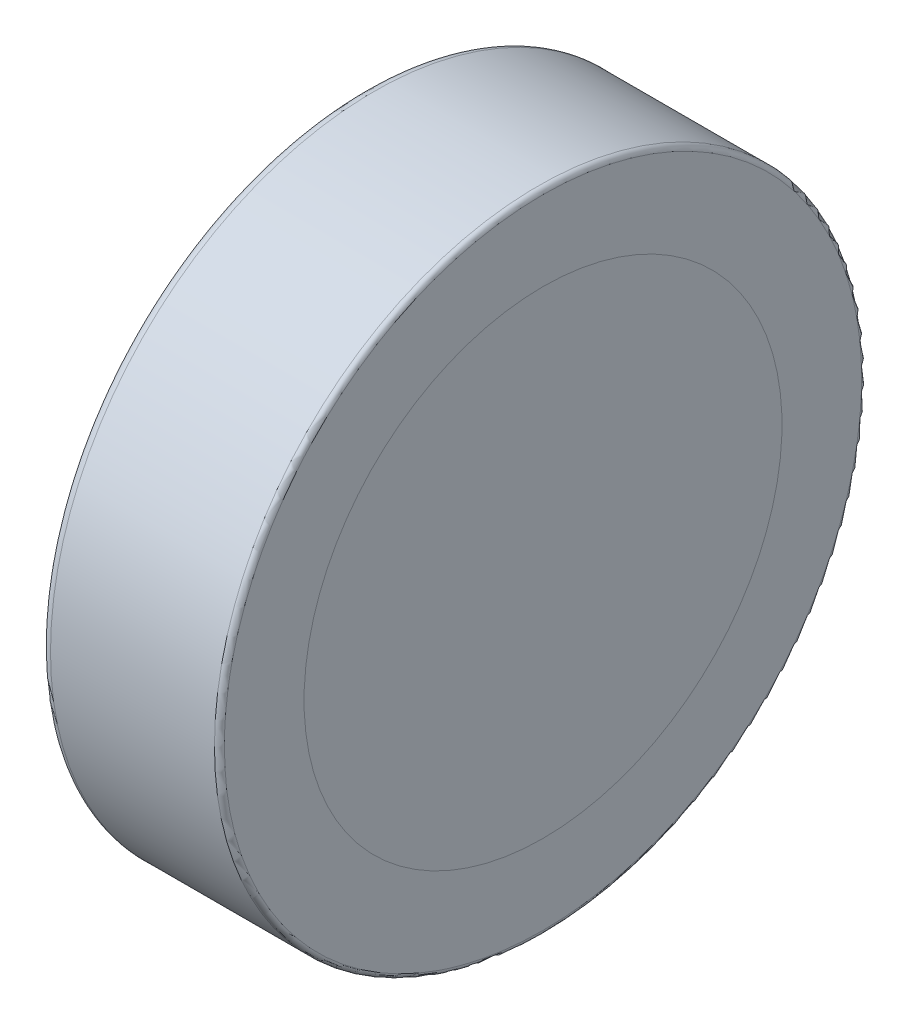
ISO-10303-21;
HEADER;
FILE_DESCRIPTION(('STEP AP214'),'2;1');
FILE_NAME('part.step','',(''),(''),'','','');
FILE_SCHEMA(('AUTOMOTIVE_DESIGN { 1 0 10303 214 1 1 1 1 }'));
ENDSEC;
DATA;
#1=APPLICATION_CONTEXT('core data for automotive mechanical design processes');
#2=APPLICATION_PROTOCOL_DEFINITION('international standard','automotive_design',2000,#1);
#3=PRODUCT_CONTEXT('',#1,'mechanical');
#4=PRODUCT('Part','Part','',(#3));
#5=PRODUCT_RELATED_PRODUCT_CATEGORY('part','',(#4));
#6=PRODUCT_DEFINITION_FORMATION('','',#4);
#7=PRODUCT_DEFINITION_CONTEXT('part definition',#1,'design');
#8=PRODUCT_DEFINITION('design','',#6,#7);
#9=PRODUCT_DEFINITION_SHAPE('','',#8);
#10=(LENGTH_UNIT() NAMED_UNIT(*) SI_UNIT(.MILLI.,.METRE.));
#11=(NAMED_UNIT(*) PLANE_ANGLE_UNIT() SI_UNIT($,.RADIAN.));
#12=(NAMED_UNIT(*) SI_UNIT($,.STERADIAN.) SOLID_ANGLE_UNIT());
#13=UNCERTAINTY_MEASURE_WITH_UNIT(LENGTH_MEASURE(1.E-05),#10,'distance_accuracy_value','');
#14=(GEOMETRIC_REPRESENTATION_CONTEXT(3) GLOBAL_UNCERTAINTY_ASSIGNED_CONTEXT((#13)) GLOBAL_UNIT_ASSIGNED_CONTEXT((#10,
#11,#12)) REPRESENTATION_CONTEXT('',''));
#15=CARTESIAN_POINT('',(0.,0.,0.));
#16=DIRECTION('',(0.,0.,1.));
#17=DIRECTION('',(1.,0.,0.));
#18=AXIS2_PLACEMENT_3D('',#15,#16,#17);
#19=CARTESIAN_POINT('',(0.,0.,0.));
#20=CARTESIAN_POINT('',(0.,0.05210462956972,0.));
#21=CARTESIAN_POINT('',(0.000691743719357,0.1284688546661,0.));
#22=CARTESIAN_POINT('',(0.002807581872069,0.2275721547956,0.));
#23=CARTESIAN_POINT('',(0.004859000108526,0.2964452651658,0.));
#24=CARTESIAN_POINT('',(0.007338098680728,0.3623728956788,0.));
#25=CARTESIAN_POINT('',(0.01108175794887,0.446332212166,0.));
#26=CARTESIAN_POINT('',(0.01659405408443,0.5467939628838,0.));
#27=CARTESIAN_POINT('',(0.02452405060196,0.6623831661137,0.));
#28=CARTESIAN_POINT('',(0.03342034570394,0.7718529726198,0.));
#29=CARTESIAN_POINT('',(0.04312301043329,0.8759479775652,0.));
#30=CARTESIAN_POINT('',(0.0567565751218,1.005972165797,0.));
#31=CARTESIAN_POINT('',(0.07535064032635,1.159556440921,0.));
#32=CARTESIAN_POINT('',(0.1001603521466,1.334563784432,0.));
#33=CARTESIAN_POINT('',(0.126567923967,1.498735088347,0.));
#34=CARTESIAN_POINT('',(0.1628739328407,1.701036667309,0.));
#35=CARTESIAN_POINT('',(0.2113052265627,1.93751980655,0.));
#36=CARTESIAN_POINT('',(0.264899151646,2.163486720934,0.));
#37=CARTESIAN_POINT('',(0.3091323544031,2.333670503212,0.));
#38=CARTESIAN_POINT('',(0.3423389397371,2.454767455131,0.));
#39=CARTESIAN_POINT('',(0.3764926118203,2.573083380578,0.));
#40=CARTESIAN_POINT('',(0.401257654654,2.654976060904,0.));
#41=CARTESIAN_POINT('',(0.4145214949657,2.697749178215,0.));
#42=CARTESIAN_POINT('',(0.4157253445419,2.701622611334,0.));
#43=(BOUNDED_CURVE() B_SPLINE_CURVE(3,(#19,#20,#21,#22,#23,#24,#25,#26,#27,#28,#29,#30,#31,#32,
#33,#34,#35,#36,#37,#38,#39,#40,#41,#42),.UNSPECIFIED.,.F.,.F.) B_SPLINE_CURVE_WITH_KNOTS((4,1,
1,1,1,1,1,1,1,1,1,1,1,1,1,1,1,1,1,1,1,4),(0.,0.05696984657492,0.08349251728804,0.1083809270558,
0.1323063759205,0.155626371483,0.2002704933321,0.2423100109975,0.2823020909419,0.3203536018846,
0.3566154027821,0.425244082915,0.4894911137433,0.5498654616583,0.6070413953905,0.714206745952,
0.8137482966662,0.8609231050626,0.9064589435848,0.9510359757461,0.9955650489481,1.),
.UNSPECIFIED.) CURVE() GEOMETRIC_REPRESENTATION_ITEM() RATIONAL_B_SPLINE_CURVE((1.,1.,1.,1.,1.,
1.,1.,1.,1.,1.,1.,1.,1.,1.,1.,1.,1.,1.,1.,1.,1.,1.,1.,1.)) REPRESENTATION_ITEM(''));
#44=CARTESIAN_POINT('',(-0.110426619,0.,0.));
#45=DIRECTION('',(-1.,0.,0.));
#46=AXIS1_PLACEMENT('',#44,#45);
#47=SURFACE_OF_REVOLUTION('',#43,#46);
#48=CARTESIAN_POINT('',(0.,0.,0.));
#49=VERTEX_POINT('',#48);
#50=VERTEX_LOOP('',#49);
#51=FACE_BOUND('',#50,.T.);
#52=CARTESIAN_POINT('',(0.407699374531264,0.,0.));
#53=DIRECTION('',(1.,0.,0.));
#54=DIRECTION('',(0.,-0.999999564133861,0.000933665939788664));
#55=AXIS2_PLACEMENT_3D('',#52,#53,#54);
#56=CIRCLE('',#55,2.67566858006498);
#57=CARTESIAN_POINT('',(0.407699374531264,-2.67566741383165,0.00249818061936937));
#58=VERTEX_POINT('',#57);
#59=EDGE_CURVE('E64',#58,#58,#56,.F.);
#60=ORIENTED_EDGE('',*,*,#59,.T.);
#61=EDGE_LOOP('',(#60));
#62=FACE_BOUND('',#61,.T.);
#63=ADVANCED_FACE('F15',(#51,#62),#47,.F.);
#64=CARTESIAN_POINT('',(0.3121211975973,0.,0.));
#65=DIRECTION('',(1.,0.,0.));
#66=DIRECTION('',(0.,-0.999999564133861,0.000933665939788664));
#67=AXIS2_PLACEMENT_3D('',#64,#65,#66);
#68=TOROIDAL_SURFACE('',#67,2.705076267733,0.1);
#69=CARTESIAN_POINT('',(0.4121211975973,0.,0.));
#70=DIRECTION('',(-1.,0.,0.));
#71=DIRECTION('',(0.,1.,0.));
#72=AXIS2_PLACEMENT_3D('',#69,#70,#71);
#73=CIRCLE('',#72,2.7050762677225);
#74=CARTESIAN_POINT('',(0.4121211975973,-2.7050762677183,0.));
#75=VERTEX_POINT('',#74);
#76=CARTESIAN_POINT('',(0.4121211975973,2.7050762677183,0.));
#77=VERTEX_POINT('',#76);
#78=EDGE_CURVE('E197',#75,#77,#73,.F.);
#79=ORIENTED_EDGE('',*,*,#78,.F.);
#80=CARTESIAN_POINT('',(0.4121211975973,-2.705076267712,0.));
#81=CARTESIAN_POINT('',(0.412121197595779,-2.70507594866538,0.000841876478011887));
#82=CARTESIAN_POINT('',(0.412121197594299,-2.70507524148156,0.00168375551697466));
#83=CARTESIAN_POINT('',(0.412121197516631,-2.7050162000783,0.0470641840690194));
#84=CARTESIAN_POINT('',(0.412121197548796,-2.70387195698707,0.0916087202426596));
#85=CARTESIAN_POINT('',(0.41212119698625,-2.69937197879863,0.181399161037708));
#86=CARTESIAN_POINT('',(0.412121196380058,-2.69597615775904,0.226642983681117));
#87=CARTESIAN_POINT('',(0.41212115323586,-2.68693932793262,0.31689388639987));
#88=CARTESIAN_POINT('',(0.412121110711048,-2.68129902585015,0.361901036479485));
#89=CARTESIAN_POINT('',(0.41212080987294,-2.66937697683153,0.441129098101552));
#90=CARTESIAN_POINT('',(0.412120604145867,-2.66355087729823,0.475419858677809));
#91=CARTESIAN_POINT('',(0.412120006021443,-2.64661619862147,0.564524892862536));
#92=CARTESIAN_POINT('',(0.412119576171417,-2.63444937133538,0.619143750704688));
#93=CARTESIAN_POINT('',(0.412119450723772,-2.60927039123773,0.717206774535503));
#94=CARTESIAN_POINT('',(0.41211963137773,-2.59685575805295,0.760806440257988));
#95=CARTESIAN_POINT('',(0.412120249233156,-2.56983133195316,0.847281762607399));
#96=CARTESIAN_POINT('',(0.412120686198422,-2.55522356930244,0.890158048480771));
#97=CARTESIAN_POINT('',(0.41212108824896,-2.53134083452116,0.95449082572087));
#98=CARTESIAN_POINT('',(0.41212117937801,-2.5229095666168,0.976264041529427));
#99=CARTESIAN_POINT('',(0.412121205038305,-2.51073398388129,1.00680989090429));
#100=CARTESIAN_POINT('',(0.412121200314658,-2.50716731485812,1.01565425491872));
#101=CARTESIAN_POINT('',(0.412121175827272,-2.48409958806341,1.07204504135777));
#102=CARTESIAN_POINT('',(0.412121181034625,-2.4633619504549,1.11909927895228));
#103=CARTESIAN_POINT('',(0.412120976175299,-2.4277015965774,1.19411238412908));
#104=CARTESIAN_POINT('',(0.412120847981517,-2.41360266848985,1.22246741779828));
#105=CARTESIAN_POINT('',(0.412120515708989,-2.38352353437018,1.28038780384479));
#106=CARTESIAN_POINT('',(0.412120307460483,-2.36748098610239,1.30992080973027));
#107=CARTESIAN_POINT('',(0.412119825165105,-2.32759951450314,1.38014455592881));
#108=CARTESIAN_POINT('',(0.412119558435392,-2.30322473364989,1.42053389198287));
#109=CARTESIAN_POINT('',(0.412119433880697,-2.27195180989262,1.46935472857995));
#110=CARTESIAN_POINT('',(0.412119419343729,-2.2660547674011,1.47843742122417));
#111=CARTESIAN_POINT('',(0.412119382770715,-2.24025117040221,1.5176552207492));
#112=CARTESIAN_POINT('',(0.412119422486852,-2.21978523973986,1.54742551737038));
#113=CARTESIAN_POINT('',(0.412119615082913,-2.17008788221289,1.61666526646487));
#114=CARTESIAN_POINT('',(0.412119803523228,-2.14035105060356,1.65577253176815));
#115=CARTESIAN_POINT('',(0.41212027796573,-2.07880070136791,1.73228283360008));
#116=CARTESIAN_POINT('',(0.412120563914527,-2.04698832786471,1.76968679007217));
#117=CARTESIAN_POINT('',(0.412121002437545,-1.98086943613019,1.84311540439738));
#118=CARTESIAN_POINT('',(0.412121153210296,-1.9465356427806,1.87911548756725));
#119=CARTESIAN_POINT('',(0.412121225748504,-1.88899267168601,1.93649958133768));
#120=CARTESIAN_POINT('',(0.412121211104329,-1.86630763588436,1.95841355111555));
#121=CARTESIAN_POINT('',(0.412121165183082,-1.8237595688927,1.9981187663924));
#122=CARTESIAN_POINT('',(0.412121136828344,-1.80400262794068,2.01602350596534));
#123=CARTESIAN_POINT('',(0.412120998394618,-1.75816210091293,2.056357476475));
#124=CARTESIAN_POINT('',(0.412120866985381,-1.73190651525706,2.07859168702256));
#125=CARTESIAN_POINT('',(0.412120539287769,-1.6813408554444,2.11977844873468));
#126=CARTESIAN_POINT('',(0.412120351175665,-1.65711271526354,2.13883169762503));
#127=CARTESIAN_POINT('',(0.412120002529433,-1.6104669334803,2.17422543195386));
#128=CARTESIAN_POINT('',(0.412119841118574,-1.58811050721243,2.19064666711174));
#129=CARTESIAN_POINT('',(0.412119561604022,-1.53857707107697,2.22584999589178));
#130=CARTESIAN_POINT('',(0.412119457654225,-1.51129469483883,2.24448418148387));
#131=CARTESIAN_POINT('',(0.412119395044954,-1.45826243708839,2.27927194677585));
#132=CARTESIAN_POINT('',(0.4121194254337,-1.43256442749078,2.29550474012419));
#133=CARTESIAN_POINT('',(0.412119539540447,-1.38063920732634,2.32708236825473));
#134=CARTESIAN_POINT('',(0.412119623241735,-1.35441216510547,2.34242747968102));
#135=CARTESIAN_POINT('',(0.412119824494285,-1.30653738680668,2.36935371241533));
#136=CARTESIAN_POINT('',(0.412119932455138,-1.28497772791749,2.38109165532872));
#137=CARTESIAN_POINT('',(0.412120166524876,-1.24155012765164,2.4039661571606));
#138=CARTESIAN_POINT('',(0.412120292628816,-1.21968227174503,2.41510287882829));
#139=CARTESIAN_POINT('',(0.412120672151375,-1.15364977377421,2.44759614766522));
#140=CARTESIAN_POINT('',(0.412120926910353,-1.10903395176535,2.46804830937459));
#141=CARTESIAN_POINT('',(0.412121150396383,-1.04081559355675,2.49706788622033));
#142=CARTESIAN_POINT('',(0.412121198065071,-1.0176001714429,2.50655854276324));
#143=CARTESIAN_POINT('',(0.412121197182678,-0.97360675433624,2.52384028679304));
#144=CARTESIAN_POINT('',(0.412121159086963,-0.952856178845155,2.53170119394997));
#145=CARTESIAN_POINT('',(0.412121046010549,-0.889392224438764,2.55488590439233));
#146=CARTESIAN_POINT('',(0.412120974088265,-0.846388740156109,2.56942375963757));
#147=CARTESIAN_POINT('',(0.412120993531711,-0.759772382406192,2.59637938990315));
#148=CARTESIAN_POINT('',(0.412121084731759,-0.716160171855171,2.60879930207658));
#149=CARTESIAN_POINT('',(0.41212126730586,-0.628416940855727,2.63147185769049));
#150=CARTESIAN_POINT('',(0.412121358679672,-0.584286440841775,2.64172650673898));
#151=CARTESIAN_POINT('',(0.412120586935178,-0.528410292130013,2.65334617391147));
#152=CARTESIAN_POINT('',(0.412120379956183,-0.516859745935704,2.65567521281033));
#153=CARTESIAN_POINT('',(0.412120085081168,-0.487989708847852,2.66123985772122));
#154=CARTESIAN_POINT('',(0.412120106943632,-0.470646466724459,2.66435312100657));
#155=CARTESIAN_POINT('',(0.412120206535916,-0.426230649904482,2.67187414417753));
#156=CARTESIAN_POINT('',(0.412120308592492,-0.399116958255985,2.67603764166973));
#157=CARTESIAN_POINT('',(0.412120568740461,-0.332808050669356,2.68517663792776));
#158=CARTESIAN_POINT('',(0.412120731718784,-0.293549744869248,2.68970249994354));
#159=CARTESIAN_POINT('',(0.412120948919075,-0.226097167074397,2.69598517139672));
#160=CARTESIAN_POINT('',(0.41212102090252,-0.197941142517661,2.69816359324299));
#161=CARTESIAN_POINT('',(0.412121116519947,-0.146698824659073,2.70132482054776));
#162=CARTESIAN_POINT('',(0.412121146564754,-0.123621453857955,2.7024529901562));
#163=CARTESIAN_POINT('',(0.41212119299744,-0.0666176064524484,2.70451414519423));
#164=CARTESIAN_POINT('',(0.412121196373415,-0.0326785352027483,2.70510749229993));
#165=CARTESIAN_POINT('',(0.412121199214687,0.0461305131416268,2.70503375675536));
#166=CARTESIAN_POINT('',(0.412121197070421,0.0910007835974372,2.70389921700952));
#167=CARTESIAN_POINT('',(0.412121194224446,0.181042098578864,2.6993698416311));
#168=CARTESIAN_POINT('',(0.412121193536232,0.226212096940261,2.69595424147889));
#169=CARTESIAN_POINT('',(0.412121192657476,0.31632411820363,2.68686617773267));
#170=CARTESIAN_POINT('',(0.41212119246693,0.361266142251395,2.68119372549296));
#171=CARTESIAN_POINT('',(0.412121193195854,0.450809226818168,2.66760202041036));
#172=CARTESIAN_POINT('',(0.412121194115321,0.495410287864116,2.6596827710405));
#173=CARTESIAN_POINT('',(0.412121196092519,0.584159186847491,2.64161866828816));
#174=CARTESIAN_POINT('',(0.412121197150249,0.628307023905747,2.63147381058926));
#175=CARTESIAN_POINT('',(0.412121197853056,0.716039758378451,2.60898299543482));
#176=CARTESIAN_POINT('',(0.412121197498124,0.759624652737868,2.59663702603945));
#177=CARTESIAN_POINT('',(0.412121192752846,0.840245993657995,2.57160095201263));
#178=CARTESIAN_POINT('',(0.412121188916908,0.877368130082561,2.55918512972018));
#179=CARTESIAN_POINT('',(0.412121174326753,0.966531119661922,2.52719672817725));
#180=CARTESIAN_POINT('',(0.412121161341991,1.01828276754597,2.50680981535198));
#181=CARTESIAN_POINT('',(0.412121131491673,1.11432148638696,2.46551187469932));
#182=CARTESIAN_POINT('',(0.412121115275374,1.15876149331517,2.44495466879755));
#183=CARTESIAN_POINT('',(0.412121078929547,1.24646241689806,2.401458075243));
#184=CARTESIAN_POINT('',(0.412121058799954,1.28972331383293,2.37851864778001));
#185=CARTESIAN_POINT('',(0.412121015590482,1.37493674485167,2.33032552107743));
#186=CARTESIAN_POINT('',(0.412120992510557,1.41688925818084,2.3050717851513));
#187=CARTESIAN_POINT('',(0.412120944190378,1.49936263111944,2.2523243292997));
#188=CARTESIAN_POINT('',(0.412120918950092,1.539883469251,2.22483057579013));
#189=CARTESIAN_POINT('',(0.412120867070133,1.61937387521139,2.16768407372463));
#190=CARTESIAN_POINT('',(0.412120840430442,1.65834342110285,2.13803129465392));
#191=CARTESIAN_POINT('',(0.41212078647743,1.73461624873378,2.07665419523025));
#192=CARTESIAN_POINT('',(0.412120759164101,1.77191950834315,2.04492984737835));
#193=CARTESIAN_POINT('',(0.412120704435095,1.84475002284486,1.97950271902275));
#194=CARTESIAN_POINT('',(0.412120677019417,1.88027725567703,1.94579991395578));
#195=CARTESIAN_POINT('',(0.41212062298586,1.94944979460938,1.87651656590772));
#196=CARTESIAN_POINT('',(0.41212059636799,1.98309507895187,1.8409360012266));
#197=CARTESIAN_POINT('',(0.412120539454704,2.05320067058093,1.76264537083127));
#198=CARTESIAN_POINT('',(0.412120509192837,2.08934951548962,1.71965529684648));
#199=CARTESIAN_POINT('',(0.412120462762046,2.14889135925283,1.64419511932205));
#200=CARTESIAN_POINT('',(0.412120445043324,2.17296230248963,1.61225645665041));
#201=CARTESIAN_POINT('',(0.412120414692026,2.22368135479544,1.54175727251509));
#202=CARTESIAN_POINT('',(0.412120403458366,2.25006066844562,1.50300262888491));
#203=CARTESIAN_POINT('',(0.412120390695596,2.30076771470105,1.42417539198112));
#204=CARTESIAN_POINT('',(0.412120389166423,2.3250954603915,1.38410280711581));
#205=CARTESIAN_POINT('',(0.41212039622326,2.37163443989757,1.3027470312233));
#206=CARTESIAN_POINT('',(0.412120404809178,2.39384569306812,1.26146385127129));
#207=CARTESIAN_POINT('',(0.412120431528546,2.43609135195957,1.17779903511758));
#208=CARTESIAN_POINT('',(0.412120449661883,2.45612578360957,1.13541741200738));
#209=CARTESIAN_POINT('',(0.412120494458531,2.49396368132689,1.04967042655508));
#210=CARTESIAN_POINT('',(0.412120521121717,2.51176718014013,1.00630507866324));
#211=CARTESIAN_POINT('',(0.412120581368945,2.54509506825052,0.918708133988963));
#212=CARTESIAN_POINT('',(0.412120614952865,2.56061949730584,0.874476552333159));
#213=CARTESIAN_POINT('',(0.412120686879076,2.58934730829846,0.785266945148846));
#214=CARTESIAN_POINT('',(0.412120725221269,2.60255073714754,0.740288934727178));
#215=CARTESIAN_POINT('',(0.412120803937014,2.62660091348624,0.649708301628215));
#216=CARTESIAN_POINT('',(0.412120844310518,2.63744771512901,0.604105693329212));
#217=CARTESIAN_POINT('',(0.412120923803744,2.65675536710629,0.512399379056237));
#218=CARTESIAN_POINT('',(0.412120962923497,2.66521627886936,0.466295686015239));
#219=CARTESIAN_POINT('',(0.412121036051487,2.67972948285284,0.373712075035544));
#220=CARTESIAN_POINT('',(0.412121070059869,2.68578184375185,0.327232167862967));
#221=CARTESIAN_POINT('',(0.412121128586215,2.69546134251778,0.234021987541543));
#222=CARTESIAN_POINT('',(0.412121153104477,2.69908855625014,0.187291722270705));
#223=CARTESIAN_POINT('',(0.412121187559247,2.70390950008654,0.093707447165551));
#224=CARTESIAN_POINT('',(0.412121197496251,2.70510331305185,0.0468534415991964));
#225=CARTESIAN_POINT('',(0.4121211975973,2.705076267712,0.));
#226=B_SPLINE_CURVE_WITH_KNOTS('',3,(#80,#81,#82,#83,#84,#85,#86,#87,#88,#89,#90,#91,#92,#93,
#94,#95,#96,#97,#98,#99,#100,#101,#102,#103,#104,#105,#106,#107,#108,#109,#110,#111,#112,#113,
#114,#115,#116,#117,#118,#119,#120,#121,#122,#123,#124,#125,#126,#127,#128,#129,#130,#131,#132,
#133,#134,#135,#136,#137,#138,#139,#140,#141,#142,#143,#144,#145,#146,#147,#148,#149,#150,#151,
#152,#153,#154,#155,#156,#157,#158,#159,#160,#161,#162,#163,#164,#165,#166,#167,#168,#169,#170,
#171,#172,#173,#174,#175,#176,#177,#178,#179,#180,#181,#182,#183,#184,#185,#186,#187,#188,#189,
#190,#191,#192,#193,#194,#195,#196,#197,#198,#199,#200,#201,#202,#203,#204,#205,#206,#207,#208,
#209,#210,#211,#212,#213,#214,#215,#216,#217,#218,#219,#220,#221,#222,#223,#224,#225),
.UNSPECIFIED.,.F.,.F.,(4,2,2,2,2,2,2,2,2,2,2,2,2,2,2,2,2,2,2,2,2,2,2,2,2,2,2,2,2,2,2,2,2,2,2,2,
2,2,2,2,2,2,2,2,2,2,2,2,2,2,2,2,2,2,2,2,2,2,2,2,2,2,2,2,2,2,2,2,2,2,2,2,4),(0.,
0.0025256375867827,0.13614096495941,0.272201381030314,0.40821899054507,0.512545146299632,
0.680290033764152,0.816234459224887,0.952053802967928,1.02209313929412,1.05070272619035,
1.20486780831807,1.29985135842497,1.40065696428599,1.5420995438849,1.57458690549914,
1.68293425399038,1.8302464750467,1.97747816672091,2.1266440182982,2.2212521033733,
2.30122986432992,2.40441937296643,2.49686876107496,2.58007370413048,2.6791658752158,
2.77033542235496,2.86147640191709,2.9351105119542,3.0087245884192,3.15587626232234,
3.23110961766092,3.29767303420269,3.43379794805849,3.56978467891859,3.70564489201078,
3.74099318251226,3.79384949965951,3.87613243747506,3.99464479087076,4.07935243215702,
4.1486600911962,4.25046992512982,4.38506736717215,4.52090706206063,4.65674607354419,
4.79258487505357,4.92842394001531,5.06426374185175,5.18166131762241,5.34841434686131,
5.49523853609752,5.64206517936442,5.78889415053752,5.93572532349137,6.08255857209964,
6.22939377023517,6.37623079177004,6.52306951057557,6.69145674628836,6.81140261688953,
6.95197819204131,7.09255287051268,7.23312626333071,7.37369798153191,7.51426763616186,
7.65483483827502,7.79539919893444,7.9359603292117,8.076517840187,8.2170713429493,
8.35762044859686,8.49816476823781),.UNSPECIFIED.);
#227=EDGE_CURVE('E63',#77,#75,#226,.F.);
#228=ORIENTED_EDGE('',*,*,#227,.F.);
#229=EDGE_LOOP('',(#79,#228));
#230=FACE_BOUND('',#229,.T.);
#231=ORIENTED_EDGE('',*,*,#59,.F.);
#232=EDGE_LOOP('',(#231));
#233=FACE_BOUND('',#232,.T.);
#234=ADVANCED_FACE('F178',(#230,#233),#68,.F.);
#235=CARTESIAN_POINT('',(2.2085324376,2.448000000377,0.));
#236=CARTESIAN_POINT('',(2.2085324184,2.432000000252,0.));
#237=CARTESIAN_POINT('',(2.2085314392,1.616000000126,0.));
#238=CARTESIAN_POINT('',(2.20853046,0.8,0.));
#239=CARTESIAN_POINT('',(2.2085295,0.,0.));
#240=(BOUNDED_CURVE() B_SPLINE_CURVE(3,(#235,#236,#237,#238,#239),.UNSPECIFIED.,.F.,
.F.) B_SPLINE_CURVE_WITH_KNOTS((4,1,4),(0.,0.01960784328843,1.),
.UNSPECIFIED.) CURVE() GEOMETRIC_REPRESENTATION_ITEM() RATIONAL_B_SPLINE_CURVE((1.,1.,1.,1.,1.)) REPRESENTATION_ITEM(''));
#241=CARTESIAN_POINT('',(-0.110426619,0.,0.));
#242=DIRECTION('',(-1.,0.,0.));
#243=AXIS1_PLACEMENT('',#241,#242);
#244=SURFACE_OF_REVOLUTION('',#240,#243);
#245=CARTESIAN_POINT('',(2.2085295,0.,0.));
#246=VERTEX_POINT('',#245);
#247=VERTEX_LOOP('',#246);
#248=FACE_BOUND('',#247,.T.);
#249=CARTESIAN_POINT('',(2.20853238,0.,0.));
#250=DIRECTION('',(1.,0.,0.));
#251=DIRECTION('',(0.,-1.,0.));
#252=AXIS2_PLACEMENT_3D('',#249,#250,#251);
#253=CIRCLE('',#252,2.40000000287112);
#254=CARTESIAN_POINT('',(2.20853238,-2.40000000172267,0.));
#255=VERTEX_POINT('',#254);
#256=CARTESIAN_POINT('',(2.20853238,2.40000000172267,0.));
#257=VERTEX_POINT('',#256);
#258=EDGE_CURVE('E71',#255,#257,#253,.T.);
#259=ORIENTED_EDGE('',*,*,#258,.T.);
#260=CARTESIAN_POINT('',(2.20853238,0.,0.));
#261=DIRECTION('',(1.,0.,0.));
#262=DIRECTION('',(0.,1.,0.));
#263=AXIS2_PLACEMENT_3D('',#260,#261,#262);
#264=CIRCLE('',#263,2.40000000287112);
#265=EDGE_CURVE('E129',#257,#255,#264,.T.);
#266=ORIENTED_EDGE('',*,*,#265,.T.);
#267=EDGE_LOOP('',(#259,#266));
#268=FACE_BOUND('',#267,.T.);
#269=ADVANCED_FACE('F170',(#248,#268),#244,.F.);
#270=CARTESIAN_POINT('',(0.4121211975973,0.,0.));
#271=DIRECTION('',(-1.,0.,0.));
#272=DIRECTION('',(0.,0.,1.));
#273=AXIS2_PLACEMENT_3D('',#270,#271,#272);
#274=PLANE('',#273);
#275=ORIENTED_EDGE('',*,*,#227,.T.);
#276=ORIENTED_EDGE('',*,*,#78,.T.);
#277=EDGE_LOOP('',(#275,#276));
#278=FACE_BOUND('',#277,.T.);
#279=CARTESIAN_POINT('',(0.4121211975973,3.150000000003,0.));
#280=CARTESIAN_POINT('',(0.41212120178476,3.14998760603042,0.0377489417909969));
#281=CARTESIAN_POINT('',(0.412121200094011,3.14930426582217,0.0754975983704987));
#282=CARTESIAN_POINT('',(0.412121196920241,3.14659827772739,0.15093398960208));
#283=CARTESIAN_POINT('',(0.412121195437149,3.14457608662236,0.188621740639035));
#284=CARTESIAN_POINT('',(0.412121204627889,3.13919584543509,0.263889531980697));
#285=CARTESIAN_POINT('',(0.412121215297765,3.1358382302079,0.301469603340942));
#286=CARTESIAN_POINT('',(0.412121293690256,3.12779325191953,0.376475001471875));
#287=CARTESIAN_POINT('',(0.412121361395199,3.12310630104412,0.413900372566533));
#288=CARTESIAN_POINT('',(0.412121611367981,3.11240787727145,0.488551502580736));
#289=CARTESIAN_POINT('',(0.412121793602121,3.1063967943191,0.525777316968796));
#290=CARTESIAN_POINT('',(0.412122167082512,3.09806398642406,0.572157806050245));
#291=CARTESIAN_POINT('',(0.412122249053983,3.09635664679594,0.581425430582091));
#292=CARTESIAN_POINT('',(0.412122582233903,3.08935072070368,0.618502973082446));
#293=CARTESIAN_POINT('',(0.412122843368438,3.08371251105135,0.646249674120897));
#294=CARTESIAN_POINT('',(0.412123315749091,3.06966444572493,0.710770451424242));
#295=CARTESIAN_POINT('',(0.412123481565773,3.06095623240041,0.747479760743902));
#296=CARTESIAN_POINT('',(0.412123537036249,3.04219932179736,0.820521811527144));
#297=CARTESIAN_POINT('',(0.412123426918919,3.03215174200523,0.856854839993387));
#298=CARTESIAN_POINT('',(0.412122982866109,3.01072544360614,0.929091347848717));
#299=CARTESIAN_POINT('',(0.412122649124607,2.99934788570692,0.964995172089583));
#300=CARTESIAN_POINT('',(0.412121945069506,2.97530641330406,1.03633537008351));
#301=CARTESIAN_POINT('',(0.41212157478922,2.96264367021085,1.07177213683843));
#302=CARTESIAN_POINT('',(0.412121268209952,2.9426249604857,1.12452205429003));
#303=CARTESIAN_POINT('',(0.412121207469458,2.93578371455499,1.14203211752187));
#304=CARTESIAN_POINT('',(0.412121193870844,2.92620950955793,1.16609132980359));
#305=CARTESIAN_POINT('',(0.41212119739234,2.92357029431829,1.17267807716175));
#306=CARTESIAN_POINT('',(0.412121210504886,2.90848023210625,1.21001611936476));
#307=CARTESIAN_POINT('',(0.412121194832497,2.89562027212026,1.24060290204251));
#308=CARTESIAN_POINT('',(0.412121271786423,2.85510273028837,1.33285946905921));
#309=CARTESIAN_POINT('',(0.412121493555134,2.82592778666103,1.39387414534184));
#310=CARTESIAN_POINT('',(0.412122118969495,2.77637957016834,1.48947956839363));
#311=CARTESIAN_POINT('',(0.412122411966477,2.75725224087093,1.52472494956747));
#312=CARTESIAN_POINT('',(0.412122970841838,2.71755876069259,1.59460507222204));
#313=CARTESIAN_POINT('',(0.412123236595579,2.69698666452255,1.62923645556177));
#314=CARTESIAN_POINT('',(0.412123517398464,2.66186657274076,1.68580895752614));
#315=CARTESIAN_POINT('',(0.412123587409959,2.64770118305585,1.70798929725243));
#316=CARTESIAN_POINT('',(0.412123675861754,2.60520847107531,1.7726913200052));
#317=CARTESIAN_POINT('',(0.412123583714306,2.57610241364607,1.81470630000539));
#318=CARTESIAN_POINT('',(0.412123284015474,2.52190343329944,1.8889803392946));
#319=CARTESIAN_POINT('',(0.412123103294025,2.4971752992538,1.92150704837233));
#320=CARTESIAN_POINT('',(0.41212267270836,2.44646770181966,1.98554396807823));
#321=CARTESIAN_POINT('',(0.412122422879624,2.42048888620967,2.01705469110097));
#322=CARTESIAN_POINT('',(0.412121927105442,2.36733740811056,2.07902413845054));
#323=CARTESIAN_POINT('',(0.412121681158009,2.34016538541353,2.10948341128167));
#324=CARTESIAN_POINT('',(0.412121330675012,2.28462103468583,2.1692557321567));
#325=CARTESIAN_POINT('',(0.412121226062153,2.25624937150003,2.19856939820556));
#326=CARTESIAN_POINT('',(0.412121182116901,2.21168942619214,2.24305825230077));
#327=CARTESIAN_POINT('',(0.412121189158398,2.19584716834537,2.25858323646427));
#328=CARTESIAN_POINT('',(0.412121216260253,2.14706165871364,2.30542283974641));
#329=CARTESIAN_POINT('',(0.412121242228808,2.11361336622252,2.33621596963988));
#330=CARTESIAN_POINT('',(0.412121465036984,2.04933941656948,2.39287472691287));
#331=CARTESIAN_POINT('',(0.412121641893529,2.0186542082229,2.41889990613866));
#332=CARTESIAN_POINT('',(0.412121984476396,1.97373392788334,2.4555435501089));
#333=CARTESIAN_POINT('',(0.412122101184089,1.95988948877369,2.46664374636866));
#334=CARTESIAN_POINT('',(0.412122515378209,1.91198821771954,2.50438245443426));
#335=CARTESIAN_POINT('',(0.412122831711172,1.87746625264193,2.53043487082201));
#336=CARTESIAN_POINT('',(0.412123351936383,1.80536769142091,2.582514616439));
#337=CARTESIAN_POINT('',(0.412123548403351,1.76772907451848,2.60845610538445));
#338=CARTESIAN_POINT('',(0.412123636649606,1.70391046809725,2.65038291083671));
#339=CARTESIAN_POINT('',(0.412123607420906,1.6780358115631,2.66683524465143));
#340=CARTESIAN_POINT('',(0.412123474154589,1.61712337321313,2.70431761832403));
#341=CARTESIAN_POINT('',(0.412123348461686,1.58190130897806,2.72504937244245));
#342=CARTESIAN_POINT('',(0.412122997988902,1.51068681700004,2.76510004791968));
#343=CARTESIAN_POINT('',(0.412122773258658,1.47469478376259,2.78441967140742));
#344=CARTESIAN_POINT('',(0.412122293793551,1.40199773444811,2.82161877527479));
#345=CARTESIAN_POINT('',(0.412122039074287,1.36529309728231,2.83949899632945));
#346=CARTESIAN_POINT('',(0.412121587360066,1.29122873270363,2.87379555915351));
#347=CARTESIAN_POINT('',(0.41212139033429,1.25386936638655,2.89021267922346));
#348=CARTESIAN_POINT('',(0.41212122904911,1.19737639314952,2.91371972389761));
#349=CARTESIAN_POINT('',(0.412121197656466,1.17847323163358,2.92136767531848));
#350=CARTESIAN_POINT('',(0.412121197542458,1.14191020531087,2.93575301263833));
#351=CARTESIAN_POINT('',(0.412121224408485,1.12426044274662,2.94251609646774));
#352=CARTESIAN_POINT('',(0.412121327561522,1.0711672699958,2.96233453085348));
#353=CARTESIAN_POINT('',(0.412121426410495,1.03555126139378,2.97493093087269));
#354=CARTESIAN_POINT('',(0.412121505929395,0.963938733774943,2.9988617956531));
#355=CARTESIAN_POINT('',(0.412121486718472,0.927942634985655,3.01019752097177));
#356=CARTESIAN_POINT('',(0.412121389613983,0.855614196354145,3.03160664448639));
#357=CARTESIAN_POINT('',(0.412121311777139,0.819282215034286,3.04168125188996));
#358=CARTESIAN_POINT('',(0.412121137290343,0.746320274654626,3.06053472751777));
#359=CARTESIAN_POINT('',(0.412121040657832,0.709690621774872,3.06931478380624));
#360=CARTESIAN_POINT('',(0.4121216871707,0.645375063413837,3.08362353506363));
#361=CARTESIAN_POINT('',(0.412122225964801,0.617747871121048,3.08941567186871));
#362=CARTESIAN_POINT('',(0.412122700336062,0.562815209094453,3.10000657610445));
#363=CARTESIAN_POINT('',(0.412122646510559,0.535512801065096,3.10482123181189));
#364=CARTESIAN_POINT('',(0.412122409256757,0.46147704766375,3.11686311456868));
#365=CARTESIAN_POINT('',(0.412122161172073,0.414628751560643,3.12339501488285));
#366=CARTESIAN_POINT('',(0.412121839231145,0.344331216301562,3.13157411703587));
#367=CARTESIAN_POINT('',(0.412121740527678,0.320972226166869,3.13402519959581));
#368=CARTESIAN_POINT('',(0.412121529410021,0.26401674432451,3.13935876910827));
#369=CARTESIAN_POINT('',(0.412121429757286,0.230393820409487,3.14196396860403));
#370=CARTESIAN_POINT('',(0.412121272129457,0.155950970450319,3.14653368256434));
#371=CARTESIAN_POINT('',(0.412121227454828,0.115115253007243,3.14824557453885));
#372=CARTESIAN_POINT('',(0.412121198846438,0.0495133322644625,3.14973578435591));
#373=CARTESIAN_POINT('',(0.412121197912641,0.0247569621348076,3.15001025742627));
#374=CARTESIAN_POINT('',(0.412121197117162,-0.0376949364352666,3.14998438205617));
#375=CARTESIAN_POINT('',(0.412121198070798,-0.0753912453214211,3.14930867083645));
#376=CARTESIAN_POINT('',(0.412121200108379,-0.150734160352176,3.14659729641554));
#377=CARTESIAN_POINT('',(0.412121201192324,-0.188380766739984,3.14456163989383));
#378=CARTESIAN_POINT('',(0.41212120355955,-0.263576900960554,3.13914389238953));
#379=CARTESIAN_POINT('',(0.412121204842831,-0.301126429157403,3.13576180646405));
#380=CARTESIAN_POINT('',(0.41212120709354,-0.376079876259542,3.12765263978855));
#381=CARTESIAN_POINT('',(0.41212120806097,-0.413483795543197,3.12292556253586));
#382=CARTESIAN_POINT('',(0.412121209489065,-0.488098022285502,3.11213327760824));
#383=CARTESIAN_POINT('',(0.412121209949732,-0.52530833002376,3.10606807186635));
#384=CARTESIAN_POINT('',(0.412121210254186,-0.599487495610415,3.09260711932511));
#385=CARTESIAN_POINT('',(0.412121210097973,-0.636456353528568,3.08521137291017));
#386=CARTESIAN_POINT('',(0.412121209204783,-0.710105087001094,3.06909890324118));
#387=CARTESIAN_POINT('',(0.412121208467805,-0.746784962304964,3.06038217884217));
#388=CARTESIAN_POINT('',(0.412121206577164,-0.819808670299549,3.04163893253413));
#389=CARTESIAN_POINT('',(0.412121205423499,-0.856152502310495,3.03161240797617));
#390=CARTESIAN_POINT('',(0.412121202999166,-0.928457093050106,3.01026247182822));
#391=CARTESIAN_POINT('',(0.412121201728497,-0.964417850560967,2.9989390561167));
#392=CARTESIAN_POINT('',(0.412121199493137,-1.03591125733235,2.97500978883516));
#393=CARTESIAN_POINT('',(0.412121198528447,-1.07144390473689,2.96240393170761));
#394=CARTESIAN_POINT('',(0.412121197751781,-1.12438485225938,2.94254548522696));
#395=CARTESIAN_POINT('',(0.412121197604624,-1.14197254869444,2.93576756606791));
#396=CARTESIAN_POINT('',(0.412121197589354,-1.17851250376965,2.92130982330314));
#397=CARTESIAN_POINT('',(0.412121197745998,-1.19745380044717,2.91360228961629));
#398=CARTESIAN_POINT('',(0.412121200988334,-1.25403899223197,2.88993817967033));
#399=CARTESIAN_POINT('',(0.412121206844785,-1.2914562253775,2.87343559778037));
#400=CARTESIAN_POINT('',(0.412121250734076,-1.36561215144602,2.83900504114761));
#401=CARTESIAN_POINT('',(0.412121288755804,-1.40235107420234,2.82107756054899));
#402=CARTESIAN_POINT('',(0.412121448227891,-1.47509857837602,2.78382587251544));
#403=CARTESIAN_POINT('',(0.412121569650565,-1.51110739807327,2.76450213048267));
#404=CARTESIAN_POINT('',(0.412121936804695,-1.58234131441527,2.72448466656954));
#405=CARTESIAN_POINT('',(0.412122182496571,-1.61756665687224,2.70379138271411));
#406=CARTESIAN_POINT('',(0.412122865376098,-1.67848595955174,2.66641595218197));
#407=CARTESIAN_POINT('',(0.412123239277324,-1.70435972179,2.65002549554252));
#408=CARTESIAN_POINT('',(0.412124249409132,-1.77280567793373,2.6052326030242));
#409=CARTESIAN_POINT('',(0.412124893350065,-1.81493557582983,2.57614840824256));
#410=CARTESIAN_POINT('',(0.412125365124295,-1.88935529548588,2.52195724632066));
#411=CARTESIAN_POINT('',(0.412125331024124,-1.92192031228586,2.49722650683026));
#412=CARTESIAN_POINT('',(0.412124863039627,-1.98598831116444,2.44650766472718));
#413=CARTESIAN_POINT('',(0.412124429668518,-2.01749260281049,2.42052121680579));
#414=CARTESIAN_POINT('',(0.412123333295575,-2.07941314002961,2.36736224132475));
#415=CARTESIAN_POINT('',(0.412122670599779,-2.10983077637562,2.34019133646805));
#416=CARTESIAN_POINT('',(0.412121645809451,-2.1694410445184,2.28461996923959));
#417=CARTESIAN_POINT('',(0.412121283302783,-2.19863530342884,2.25622124915454));
#418=CARTESIAN_POINT('',(0.412121155459166,-2.24152216479506,2.21320934011123));
#419=CARTESIAN_POINT('',(0.41212118023262,-2.25555083302705,2.19892688382283));
#420=CARTESIAN_POINT('',(0.412121237473628,-2.30133890724497,2.15143744324945));
#421=CARTESIAN_POINT('',(0.412121238351574,-2.3325306332712,2.11767771572112));
#422=CARTESIAN_POINT('',(0.412121444120587,-2.39072234609186,2.05187402084097));
#423=CARTESIAN_POINT('',(0.412121630976378,-2.41784917409651,2.01994206559106));
#424=CARTESIAN_POINT('',(0.412121984940245,-2.45554360161609,1.97373395018715));
#425=CARTESIAN_POINT('',(0.412122101355288,-2.46664376531965,1.95988949708233));
#426=CARTESIAN_POINT('',(0.412122514961069,-2.50438240793036,1.91198819789343));
#427=CARTESIAN_POINT('',(0.412122831597933,-2.53043485803861,1.87746624744335));
#428=CARTESIAN_POINT('',(0.412123352056071,-2.58251462962117,1.80536769737235));
#429=CARTESIAN_POINT('',(0.412123548429744,-2.60845610832867,1.76772907591822));
#430=CARTESIAN_POINT('',(0.412123636631898,-2.6503829088161,1.70391046722681));
#431=CARTESIAN_POINT('',(0.412123607415604,-2.66683524389549,1.67803581124212));
#432=CARTESIAN_POINT('',(0.412123474161649,-2.70431761932988,1.61712337364185));
#433=CARTESIAN_POINT('',(0.412123348463185,-2.72504937355,1.58190130943));
#434=CARTESIAN_POINT('',(0.412122997987396,-2.76510004681077,1.51068681654926));
#435=CARTESIAN_POINT('',(0.412122773259706,-2.78441966798155,1.47469478238634));
#436=CARTESIAN_POINT('',(0.412122293792497,-2.82161877869693,1.40199773582459));
#437=CARTESIAN_POINT('',(0.412122039068582,-2.83949900891061,1.36529310233459));
#438=CARTESIAN_POINT('',(0.412121587365764,-2.87379554657759,1.29122872765479));
#439=CARTESIAN_POINT('',(0.41212139035603,-2.8902126323547,1.25386934757012));
#440=CARTESIAN_POINT('',(0.412121229038244,-2.91371974732301,1.19737640255454));
#441=CARTESIAN_POINT('',(0.412121197625295,-2.92136774244513,1.17847325858359));
#442=CARTESIAN_POINT('',(0.41212119757138,-2.9357452163049,1.14192983822961));
#443=CARTESIAN_POINT('',(0.412121224450315,-2.94250075905769,1.12429980813484));
#444=CARTESIAN_POINT('',(0.412121329309615,-2.96229870834716,1.07126105528147));
#445=CARTESIAN_POINT('',(0.412121431516058,-2.97488230326349,1.03567979507578));
#446=CARTESIAN_POINT('',(0.412121528140244,-2.99879090778531,0.964130567062744));
#447=CARTESIAN_POINT('',(0.412121522647037,-3.01011694939944,0.92816294331301));
#448=CARTESIAN_POINT('',(0.412121429534783,-3.03150755829288,0.855884746387522));
#449=CARTESIAN_POINT('',(0.412121341980255,-3.04157310957131,0.819574464822832));
#450=CARTESIAN_POINT('',(0.412121166515034,-3.06041489622668,0.746650382817364));
#451=CARTESIAN_POINT('',(0.412121078604655,-3.06919208572345,0.71003682841726));
#452=CARTESIAN_POINT('',(0.412121485563354,-3.08344072958644,0.645918356678526));
#453=CARTESIAN_POINT('',(0.412121837405877,-3.08918411714207,0.618473921038271));
#454=CARTESIAN_POINT('',(0.412122130467769,-3.09498164003773,0.588487143189777));
#455=CARTESIAN_POINT('',(0.412122153859464,-3.09545411855965,0.58602523368635));
#456=CARTESIAN_POINT('',(0.4121223682378,-3.10050712294115,0.559479748778729));
#457=CARTESIAN_POINT('',(0.412122227627541,-3.10473623696897,0.535329477338648));
#458=CARTESIAN_POINT('',(0.41212189233025,-3.11640985250519,0.463850814197666));
#459=CARTESIAN_POINT('',(0.412121774043647,-3.12307244095863,0.416391970970167));
#460=CARTESIAN_POINT('',(0.412121565860429,-3.13136065455524,0.345462949765526));
#461=CARTESIAN_POINT('',(0.412121492193448,-3.13382329222999,0.322087301132538));
#462=CARTESIAN_POINT('',(0.412121352765927,-3.13899411074207,0.267129735590147));
#463=CARTESIAN_POINT('',(0.412121298711166,-3.14148868700506,0.235527418282363));
#464=CARTESIAN_POINT('',(0.4121212186273,-3.14606391125454,0.163894806900898));
#465=CARTESIAN_POINT('',(0.412121203791783,-3.14786058106099,0.123846089752087));
#466=CARTESIAN_POINT('',(0.412121195963084,-3.14962017574811,0.0562346159796919));
#467=CARTESIAN_POINT('',(0.412121197592353,-3.14998072386346,0.0286816040812582));
#468=CARTESIAN_POINT('',(0.412121197598071,-3.14999968039061,0.000752875784175006));
#469=CARTESIAN_POINT('',(0.412121197597845,-3.14999987208448,0.000376437812671551));
#470=CARTESIAN_POINT('',(0.4121211975973,-3.150000000003,0.));
#471=B_SPLINE_CURVE_WITH_KNOTS('',3,(#279,#280,#281,#282,#283,#284,#285,#286,#287,#288,#289,
#290,#291,#292,#293,#294,#295,#296,#297,#298,#299,#300,#301,#302,#303,#304,#305,#306,#307,#308,
#309,#310,#311,#312,#313,#314,#315,#316,#317,#318,#319,#320,#321,#322,#323,#324,#325,#326,#327,
#328,#329,#330,#331,#332,#333,#334,#335,#336,#337,#338,#339,#340,#341,#342,#343,#344,#345,#346,
#347,#348,#349,#350,#351,#352,#353,#354,#355,#356,#357,#358,#359,#360,#361,#362,#363,#364,#365,
#366,#367,#368,#369,#370,#371,#372,#373,#374,#375,#376,#377,#378,#379,#380,#381,#382,#383,#384,
#385,#386,#387,#388,#389,#390,#391,#392,#393,#394,#395,#396,#397,#398,#399,#400,#401,#402,#403,
#404,#405,#406,#407,#408,#409,#410,#411,#412,#413,#414,#415,#416,#417,#418,#419,#420,#421,#422,
#423,#424,#425,#426,#427,#428,#429,#430,#431,#432,#433,#434,#435,#436,#437,#438,#439,#440,#441,
#442,#443,#444,#445,#446,#447,#448,#449,#450,#451,#452,#453,#454,#455,#456,#457,#458,#459,#460,
#461,#462,#463,#464,#465,#466,#467,#468,#469,#470),.UNSPECIFIED.,.F.,.F.,(4,2,2,2,2,2,2,2,2,2,2,
2,2,2,2,2,2,2,2,2,2,2,2,2,2,2,2,2,2,2,2,2,2,2,2,2,2,2,2,2,2,2,2,2,2,2,2,2,2,2,2,2,2,2,2,2,2,2,2,
2,2,2,2,2,2,2,2,2,2,2,2,2,2,2,2,2,2,2,2,2,2,2,2,2,2,2,2,2,2,2,2,2,2,2,2,4),(0.,0.11324076428201,
0.226442913622539,0.339608231011071,0.452738497630693,0.565835492845201,0.594106139900438,
0.679035790226551,0.792193712849564,0.905257807463835,1.01822395450863,1.13108804531884,
1.18748293276865,1.20877038043563,1.30829892809856,1.51102658984791,1.63130620533712,
1.75211361042997,1.83106088841535,1.98432571818866,2.10687393085499,2.22935933974772,
2.35177985586181,2.47413339324824,2.5406744580032,2.67702149349522,2.79769673834912,
2.8509299706582,2.98063688416101,3.1177269516664,3.20970223548559,3.33228045962049,
3.45479731579209,3.577250719894,3.69963859083754,3.76081025191259,3.8175112260115,
3.9308200182615,4.04401447378931,4.15709954901516,4.27008018652153,4.35475194605886,
4.43791208448052,4.57976060283652,4.65021789151903,4.75137136812858,4.87395252208635,
4.94822111986,5.06130244449789,5.17438321373371,5.28746355825031,5.40054360873054,
5.51362349585722,5.6267033503132,5.7397833027813,5.85286348394436,5.96594402448521,
6.07902505508671,6.1355680683016,6.19691301243152,6.3195643801675,6.4421733973774,
6.56474173339152,6.68727105567763,6.77914593358936,6.93265618561262,7.055298546507,
7.17778348432673,7.30010559040557,7.42225947778527,7.48231790965167,7.62016026804818,
7.74582164498292,7.79905487711332,7.92876179043081,8.06585185830008,8.15782714211899,
8.2804053662537,8.40292222242528,8.52537562652739,8.64776349747131,8.70893515854664,
8.7655727591969,8.87877050183026,8.99187465143382,9.10488994869578,9.21782112351548,
9.30192668175951,9.30944718543917,9.38299314023162,9.52670812319539,9.59721859905979,
9.69230597711711,9.81254248412033,9.89519933406535,9.89632864810219),.UNSPECIFIED.);
#472=CARTESIAN_POINT('',(0.4121211975973,-3.1500000000021,0.));
#473=VERTEX_POINT('',#472);
#474=CARTESIAN_POINT('',(0.4121211975973,3.1500000000021,0.));
#475=VERTEX_POINT('',#474);
#476=EDGE_CURVE('E56',#473,#475,#471,.F.);
#477=ORIENTED_EDGE('',*,*,#476,.T.);
#478=CARTESIAN_POINT('',(0.4121211975973,0.,0.));
#479=DIRECTION('',(1.,0.,0.));
#480=DIRECTION('',(0.,-1.,0.));
#481=AXIS2_PLACEMENT_3D('',#478,#479,#480);
#482=CIRCLE('',#481,3.1500000000015);
#483=EDGE_CURVE('E60',#473,#475,#482,.T.);
#484=ORIENTED_EDGE('',*,*,#483,.F.);
#485=EDGE_LOOP('',(#477,#484));
#486=FACE_BOUND('',#485,.T.);
#487=ADVANCED_FACE('F59',(#278,#486),#274,.T.);
#488=CARTESIAN_POINT('',(2.20853238,0.,0.));
#489=DIRECTION('',(-1.,0.,0.));
#490=DIRECTION('',(0.,0.,1.));
#491=AXIS2_PLACEMENT_3D('',#488,#489,#490);
#492=PLANE('',#491);
#493=ORIENTED_EDGE('',*,*,#265,.F.);
#494=ORIENTED_EDGE('',*,*,#258,.F.);
#495=EDGE_LOOP('',(#493,#494));
#496=FACE_BOUND('',#495,.T.);
#497=CARTESIAN_POINT('',(2.20853238,0.,0.));
#498=DIRECTION('',(-1.,0.,0.));
#499=DIRECTION('',(0.,1.,0.));
#500=AXIS2_PLACEMENT_3D('',#497,#498,#499);
#501=CIRCLE('',#500,3.2);
#502=CARTESIAN_POINT('',(2.20853238,3.2,0.));
#503=VERTEX_POINT('',#502);
#504=CARTESIAN_POINT('',(2.20853238,-3.2,0.));
#505=VERTEX_POINT('',#504);
#506=EDGE_CURVE('E70',#503,#505,#501,.T.);
#507=ORIENTED_EDGE('',*,*,#506,.F.);
#508=CARTESIAN_POINT('',(2.20853238,-3.2,0.));
#509=CARTESIAN_POINT('',(2.20853237999992,-3.19999981800012,0.000564974784822233));
#510=CARTESIAN_POINT('',(2.20853237999893,-3.1999994867049,0.00112995057922026));
#511=CARTESIAN_POINT('',(2.20853237981887,-3.19995392165941,0.0546957720467882));
#512=CARTESIAN_POINT('',(2.20853237166524,-3.19859497856355,0.107704683904797));
#513=CARTESIAN_POINT('',(2.20853235242361,-3.19322220606049,0.214147226979916));
#514=CARTESIAN_POINT('',(2.20853234130538,-3.18918034706436,0.267579393351013));
#515=CARTESIAN_POINT('',(2.20853232459388,-3.17842485805933,0.374174440425937));
#516=CARTESIAN_POINT('',(2.20853231900051,-3.17171127572314,0.427337325917517));
#517=CARTESIAN_POINT('',(2.20853231664016,-3.15562908227438,0.533259027916147));
#518=CARTESIAN_POINT('',(2.20853231987306,-3.14626050521907,0.586017849597459));
#519=CARTESIAN_POINT('',(2.20853233326541,-3.12489218065726,0.690999278573635));
#520=CARTESIAN_POINT('',(2.2085323434248,-3.11289245370449,0.743221890053871));
#521=CARTESIAN_POINT('',(2.20853236390019,-3.08629109408741,0.847001225577124));
#522=CARTESIAN_POINT('',(2.20853237421617,-3.07168946869766,0.898557951481434));
#523=CARTESIAN_POINT('',(2.20853238159721,-3.04204470811558,0.99404147239042));
#524=CARTESIAN_POINT('',(2.20853238024749,-3.02732078139456,1.03806795952397));
#525=CARTESIAN_POINT('',(2.20853235466385,-2.98948833634249,1.1435108824252));
#526=CARTESIAN_POINT('',(2.20853232119782,-2.96543037058309,1.20459005791359));
#527=CARTESIAN_POINT('',(2.20853223293112,-2.91665654371213,1.31804947306794));
#528=CARTESIAN_POINT('',(2.20853218110606,-2.89235159495337,1.37060725373507));
#529=CARTESIAN_POINT('',(2.20853206033781,-2.84092431886059,1.47433027378634));
#530=CARTESIAN_POINT('',(2.20853199139392,-2.81380187626058,1.52549545609));
#531=CARTESIAN_POINT('',(2.20853184075043,-2.75681959836428,1.62628031942306));
#532=CARTESIAN_POINT('',(2.20853175905034,-2.72695965436652,1.67589993897591));
#533=CARTESIAN_POINT('',(2.20853158673329,-2.6645900362401,1.77344777008645));
#534=CARTESIAN_POINT('',(2.208531496116,-2.6320802600773,1.82137591641052));
#535=CARTESIAN_POINT('',(2.20853130954879,-2.56450654403846,1.91539921961237));
#536=CARTESIAN_POINT('',(2.20853121359866,-2.52944250887926,1.96149430801114));
#537=CARTESIAN_POINT('',(2.20853101971953,-2.45686351377613,2.05171535934177));
#538=CARTESIAN_POINT('',(2.20853092179044,-2.41934846534689,2.09584125108574));
#539=CARTESIAN_POINT('',(2.208530726711,-2.3419773697699,2.18199397720946));
#540=CARTESIAN_POINT('',(2.20853062956066,-2.30212124091957,2.22402073823575));
#541=CARTESIAN_POINT('',(2.20853043963871,-2.22018695293594,2.30584973628503));
#542=CARTESIAN_POINT('',(2.20853034686724,-2.17810871892304,2.34565189825124));
#543=CARTESIAN_POINT('',(2.20853015106781,-2.0853637472568,2.42872727703327));
#544=CARTESIAN_POINT('',(2.20853004859528,-2.03435700111983,2.47162244730517));
#545=CARTESIAN_POINT('',(2.2085298936838,-1.94506884461446,2.54207019514914));
#546=CARTESIAN_POINT('',(2.20852983537684,-1.90742861234569,2.5704408770805));
#547=CARTESIAN_POINT('',(2.20852973534078,-1.82416086069605,2.63036196215641));
#548=CARTESIAN_POINT('',(2.20852969836901,-1.77829829927982,2.66158702366746));
#549=CARTESIAN_POINT('',(2.20852965709985,-1.68501450963874,2.72160654693513));
#550=CARTESIAN_POINT('',(2.20852965280074,-1.63759336404261,2.7504011372559));
#551=CARTESIAN_POINT('',(2.20852967808472,-1.5413197566041,2.80548315221312));
#552=CARTESIAN_POINT('',(2.2085297076659,-1.49246737499573,2.83177071704134));
#553=CARTESIAN_POINT('',(2.20852979880448,-1.39346434200943,2.88176754820343));
#554=CARTESIAN_POINT('',(2.20852986035998,-1.3433137673666,2.90547696650049));
#555=CARTESIAN_POINT('',(2.20853001200157,-1.24185039100078,2.95025376989555));
#556=CARTESIAN_POINT('',(2.20853010208589,-1.19053766152544,2.9713213187012));
#557=CARTESIAN_POINT('',(2.20853030537775,-1.08688926836377,3.0107577383582));
#558=CARTESIAN_POINT('',(2.20853041858379,-1.03455367140534,3.02912678458798));
#559=CARTESIAN_POINT('',(2.20853066086409,-0.929001539452149,3.06311693750174));
#560=CARTESIAN_POINT('',(2.20853078993727,-0.875785064640893,3.07873823107729));
#561=CARTESIAN_POINT('',(2.20853105481453,-0.768615529606269,3.10719104280268));
#562=CARTESIAN_POINT('',(2.20853119061812,-0.714662521997335,3.12002275912992));
#563=CARTESIAN_POINT('',(2.20853145796083,-0.606166240648194,3.14286232948223));
#564=CARTESIAN_POINT('',(2.20853158950027,-0.551623010935985,3.15287039265217));
#565=CARTESIAN_POINT('',(2.20853183539838,-0.442094116012779,3.170035647232));
#566=CARTESIAN_POINT('',(2.20853194975839,-0.387108485243013,3.17719305841763));
#567=CARTESIAN_POINT('',(2.20853214668743,-0.276843949038653,3.18863997940264));
#568=CARTESIAN_POINT('',(2.20853222925901,-0.221565067458732,3.19292971897543));
#569=CARTESIAN_POINT('',(2.2085323457678,-0.110571992377086,3.1986387066651));
#570=CARTESIAN_POINT('',(2.2085323794509,-0.0548570271236072,3.20004297267722));
#571=CARTESIAN_POINT('',(2.20853238052611,0.0542786822696433,3.19995885499341));
#572=CARTESIAN_POINT('',(2.20853235058674,0.107699574368286,3.19858702384857));
#573=CARTESIAN_POINT('',(2.20853236290467,0.214597041085679,3.19319598683259));
#574=CARTESIAN_POINT('',(2.2085324054176,0.268073144844498,3.18916743850289));
#575=CARTESIAN_POINT('',(2.20853235460628,0.374668506777148,3.17847796252087));
#576=CARTESIAN_POINT('',(2.20853226151597,0.427788221062163,3.17182158275978));
#577=CARTESIAN_POINT('',(2.20853205845779,0.533539000347585,3.15586731593969));
#578=CARTESIAN_POINT('',(2.20853194851879,0.586170741064881,3.14657392596923));
#579=CARTESIAN_POINT('',(2.20853050425978,0.653734212872625,3.13299203385301));
#580=CARTESIAN_POINT('',(2.20853009475336,0.668899068059103,3.12983535073529));
#581=CARTESIAN_POINT('',(2.20852999845221,0.696878628286581,3.12372542204492));
#582=CARTESIAN_POINT('',(2.20853021184553,0.709702359049956,3.1208134575134));
#583=CARTESIAN_POINT('',(2.20853124594047,0.781214184086091,3.10412434808542));
#584=CARTESIAN_POINT('',(2.20853150213133,0.839555897698059,3.08881133521544));
#585=CARTESIAN_POINT('',(2.20853197205883,0.93696892601327,3.06024110218509));
#586=CARTESIAN_POINT('',(2.20853217361512,0.97630189986445,3.04786422092854));
#587=CARTESIAN_POINT('',(2.20853234445733,1.04523673478347,3.02472041575874));
#588=CARTESIAN_POINT('',(2.2085323573534,1.07494314580712,3.01426350891676));
#589=CARTESIAN_POINT('',(2.20853239187278,1.15733003197272,2.98392369305382));
#590=CARTESIAN_POINT('',(2.20853241236666,1.20967059425071,2.96310549575168));
#591=CARTESIAN_POINT('',(2.20853228245222,1.29163724765791,2.92803561116908));
#592=CARTESIAN_POINT('',(2.20853219968133,1.32164268171906,2.91466117700889));
#593=CARTESIAN_POINT('',(2.20853186474045,1.37827463758572,2.8883752555762));
#594=CARTESIAN_POINT('',(2.20853163019484,1.40494099901553,2.87554952145458));
#595=CARTESIAN_POINT('',(2.20853080023248,1.48985729559172,2.83323185182159));
#596=CARTESIAN_POINT('',(2.20853011082084,1.54739905958098,2.80230054774076));
#597=CARTESIAN_POINT('',(2.20852905607562,1.65515765836402,2.74001009486196));
#598=CARTESIAN_POINT('',(2.20852866642631,1.70555559695633,2.70896268014544));
#599=CARTESIAN_POINT('',(2.2085284334374,1.79941162440415,2.64744338909007));
#600=CARTESIAN_POINT('',(2.20852853774956,1.84304826827766,2.61724427092064));
#601=CARTESIAN_POINT('',(2.20852934314864,1.91877542805686,2.56193056355284));
#602=CARTESIAN_POINT('',(2.20852990005237,1.95119436837178,2.53726342015695));
#603=CARTESIAN_POINT('',(2.20853108081154,2.03295394687952,2.47254847574294));
#604=CARTESIAN_POINT('',(2.20853156752018,2.08160433896145,2.43162300718124));
#605=CARTESIAN_POINT('',(2.20853202960456,2.17192980288899,2.35101774398137));
#606=CARTESIAN_POINT('',(2.2085320491015,2.21382879978336,2.31158798328552));
#607=CARTESIAN_POINT('',(2.20853201645588,2.29663991672242,2.22938601324698));
#608=CARTESIAN_POINT('',(2.20853196223702,2.33748900659917,2.18655029165392));
#609=CARTESIAN_POINT('',(2.20853142815258,2.42390573827381,2.09082374929981));
#610=CARTESIAN_POINT('',(2.20853087365134,2.46900470599064,2.03750794101709));
#611=CARTESIAN_POINT('',(2.2085293359498,2.54279238203139,1.94426725700878));
#612=CARTESIAN_POINT('',(2.20852852836822,2.57238522335186,1.90505336042466));
#613=CARTESIAN_POINT('',(2.2085270447586,2.63455575116993,1.81854543924308));
#614=CARTESIAN_POINT('',(2.20852641401432,2.6667929203379,1.77100568050691));
#615=CARTESIAN_POINT('',(2.20852562095403,2.72861426284797,1.67428141426143));
#616=CARTESIAN_POINT('',(2.20852545830456,2.75820031021211,1.6250981028535));
#617=CARTESIAN_POINT('',(2.2085256770527,2.81463894321706,1.52523427221461));
#618=CARTESIAN_POINT('',(2.20852605804622,2.84149354321369,1.47455489240109));
#619=CARTESIAN_POINT('',(2.20852725319029,2.89238336073997,1.37185096059549));
#620=CARTESIAN_POINT('',(2.20852806700568,2.91642074229273,1.31982747905588));
#621=CARTESIAN_POINT('',(2.20852969942429,2.96165669986549,1.21460437830611));
#622=CARTESIAN_POINT('',(2.20853051802314,2.98285754162773,1.1614057378359));
#623=CARTESIAN_POINT('',(2.20853173804141,3.01379296298546,1.07689796810693));
#624=CARTESIAN_POINT('',(2.20853216812462,3.02455298450613,1.04595982772245));
#625=CARTESIAN_POINT('',(2.20853221171769,3.04177604714174,0.994449551789028));
#626=CARTESIAN_POINT('',(2.20853205404903,3.04845095407405,0.973947952270792));
#627=CARTESIAN_POINT('',(2.20853177243473,3.06134814935778,0.93285193672584));
#628=CARTESIAN_POINT('',(2.20853164841597,3.06757139745877,0.912257822522949));
#629=CARTESIAN_POINT('',(2.20853121586465,3.08558868098544,0.850397002904341));
#630=CARTESIAN_POINT('',(2.2085308465193,3.0967648358215,0.808948692334905));
#631=CARTESIAN_POINT('',(2.20853026951045,3.11769186258137,0.724497626329799));
#632=CARTESIAN_POINT('',(2.20853006651129,3.12739577279415,0.681483229484038));
#633=CARTESIAN_POINT('',(2.20853001173017,3.14448435623503,0.597544870374495));
#634=CARTESIAN_POINT('',(2.20853014061862,3.15196958609227,0.55664124820813));
#635=CARTESIAN_POINT('',(2.20853060588895,3.16912564698347,0.451219038491413));
#636=CARTESIAN_POINT('',(2.2085310185994,3.17761729937251,0.386504216409614));
#637=CARTESIAN_POINT('',(2.20853165597857,3.18947162244036,0.268153897609361));
#638=CARTESIAN_POINT('',(2.20853190098743,3.19347540858326,0.214581036998957));
#639=CARTESIAN_POINT('',(2.20853225493308,3.19877118100474,0.107339392365089));
#640=CARTESIAN_POINT('',(2.20853236396576,3.20006507858102,0.0536707026877611));
#641=CARTESIAN_POINT('',(2.20853238,3.2,0.));
#642=B_SPLINE_CURVE_WITH_KNOTS('',3,(#508,#509,#510,#511,#512,#513,#514,#515,#516,#517,#518,
#519,#520,#521,#522,#523,#524,#525,#526,#527,#528,#529,#530,#531,#532,#533,#534,#535,#536,#537,
#538,#539,#540,#541,#542,#543,#544,#545,#546,#547,#548,#549,#550,#551,#552,#553,#554,#555,#556,
#557,#558,#559,#560,#561,#562,#563,#564,#565,#566,#567,#568,#569,#570,#571,#572,#573,#574,#575,
#576,#577,#578,#579,#580,#581,#582,#583,#584,#585,#586,#587,#588,#589,#590,#591,#592,#593,#594,
#595,#596,#597,#598,#599,#600,#601,#602,#603,#604,#605,#606,#607,#608,#609,#610,#611,#612,#613,
#614,#615,#616,#617,#618,#619,#620,#621,#622,#623,#624,#625,#626,#627,#628,#629,#630,#631,#632,
#633,#634,#635,#636,#637,#638,#639,#640,#641),.UNSPECIFIED.,.F.,.F.,(4,2,2,2,2,2,2,2,2,2,2,2,2,
2,2,2,2,2,2,2,2,2,2,2,2,2,2,2,2,2,2,2,2,2,2,2,2,2,2,2,2,2,2,2,2,2,2,2,2,2,2,2,2,2,2,2,2,2,2,2,2,
2,2,2,2,2,4),(0.,0.00169492758169147,0.160697222492071,0.321387393005009,0.482074696383195,
0.642759938619352,0.803443925676924,0.964127463490748,1.10335852379035,1.30016350298826,
1.47379843160371,1.64744046656696,1.82108939954606,1.99474502219412,2.16840712615027,
2.34207550304055,2.51574994447851,2.68943024206553,2.88922719193613,3.03059062259667,
3.19696151747986,3.36332360635247,3.52967638686861,3.69601935676401,3.86235201385328,
4.02867385602736,4.19498438125178,4.36128308756584,4.52756947308302,4.69384303599288,
4.8601032745648,5.02722461882804,5.18747506446996,5.34829206418664,5.50883195542945,
5.66909969481413,5.71556772390581,5.75501755774268,5.93585792559291,6.05953202473,
6.15400080193455,6.32290090145669,6.42144117920008,6.5102033608486,6.70604917724877,
6.88354179381111,7.04267185200815,7.16485489401787,7.35545928775227,7.52798487769027,
7.70547186445936,7.91480859598612,8.06214277037813,8.23437127616975,8.40647706070037,
8.5784549881222,8.75029993408236,8.9220067853948,9.02026262407987,9.08494173555643,
9.14947911905382,9.27822781534099,9.41047375458886,9.53519386341426,9.73086711203133,
9.89196872940801,10.0529566827056),.UNSPECIFIED.);
#643=EDGE_CURVE('E35',#505,#503,#642,.T.);
#644=ORIENTED_EDGE('',*,*,#643,.F.);
#645=EDGE_LOOP('',(#507,#644));
#646=FACE_BOUND('',#645,.T.);
#647=ADVANCED_FACE('F96',(#496,#646),#492,.F.);
#648=CARTESIAN_POINT('',(0.5121211975973,0.,0.));
#649=DIRECTION('',(-1.,0.,0.));
#650=DIRECTION('',(0.,-0.999999935734432,0.000358512388574211));
#651=AXIS2_PLACEMENT_3D('',#648,#649,#650);
#652=TOROIDAL_SURFACE('',#651,3.15,0.1);
#653=ORIENTED_EDGE('',*,*,#483,.T.);
#654=ORIENTED_EDGE('',*,*,#476,.F.);
#655=EDGE_LOOP('',(#653,#654));
#656=FACE_BOUND('',#655,.T.);
#657=CARTESIAN_POINT('',(0.5121211975973,0.,0.));
#658=DIRECTION('',(-1.,0.,0.));
#659=DIRECTION('',(0.,0.,1.));
#660=AXIS2_PLACEMENT_3D('',#657,#658,#659);
#661=CIRCLE('',#660,3.25);
#662=CARTESIAN_POINT('',(0.5121211975973,0.,3.25));
#663=VERTEX_POINT('',#662);
#664=EDGE_CURVE('E27',#663,#663,#661,.F.);
#665=ORIENTED_EDGE('',*,*,#664,.F.);
#666=EDGE_LOOP('',(#665));
#667=FACE_BOUND('',#666,.T.);
#668=ADVANCED_FACE('F68',(#656,#667),#652,.T.);
#669=CARTESIAN_POINT('',(2.15853238,0.,0.));
#670=DIRECTION('',(-1.,0.,0.));
#671=DIRECTION('',(0.,-0.999999859727554,0.000529664868426075));
#672=AXIS2_PLACEMENT_3D('',#669,#670,#671);
#673=TOROIDAL_SURFACE('',#672,3.2,0.05);
#674=CARTESIAN_POINT('',(2.15853238,0.,0.));
#675=DIRECTION('',(-1.,0.,0.));
#676=DIRECTION('',(0.,0.,1.));
#677=AXIS2_PLACEMENT_3D('',#674,#675,#676);
#678=CIRCLE('',#677,3.25);
#679=CARTESIAN_POINT('',(2.15853238,0.,3.25));
#680=VERTEX_POINT('',#679);
#681=EDGE_CURVE('E10',#680,#680,#678,.T.);
#682=ORIENTED_EDGE('',*,*,#681,.F.);
#683=EDGE_LOOP('',(#682));
#684=FACE_BOUND('',#683,.T.);
#685=ORIENTED_EDGE('',*,*,#643,.T.);
#686=ORIENTED_EDGE('',*,*,#506,.T.);
#687=EDGE_LOOP('',(#685,#686));
#688=FACE_BOUND('',#687,.T.);
#689=ADVANCED_FACE('F95',(#684,#688),#673,.T.);
#690=CARTESIAN_POINT('',(2.318958999,0.,0.));
#691=DIRECTION('',(-1.,0.,0.));
#692=DIRECTION('',(0.,0.,1.));
#693=AXIS2_PLACEMENT_3D('',#690,#691,#692);
#694=CYLINDRICAL_SURFACE('',#693,3.25);
#695=ORIENTED_EDGE('',*,*,#664,.T.);
#696=EDGE_LOOP('',(#695));
#697=FACE_BOUND('',#696,.T.);
#698=ORIENTED_EDGE('',*,*,#681,.T.);
#699=EDGE_LOOP('',(#698));
#700=FACE_BOUND('',#699,.T.);
#701=ADVANCED_FACE('F217',(#697,#700),#694,.T.);
#702=CLOSED_SHELL('',(#63,#234,#269,#487,#647,#668,#689,#701));
#703=MANIFOLD_SOLID_BREP('B1',#702);
#704=ADVANCED_BREP_SHAPE_REPRESENTATION('',(#18,#703),#14);
#705=SHAPE_DEFINITION_REPRESENTATION(#9,#704);
ENDSEC;
END-ISO-10303-21;
